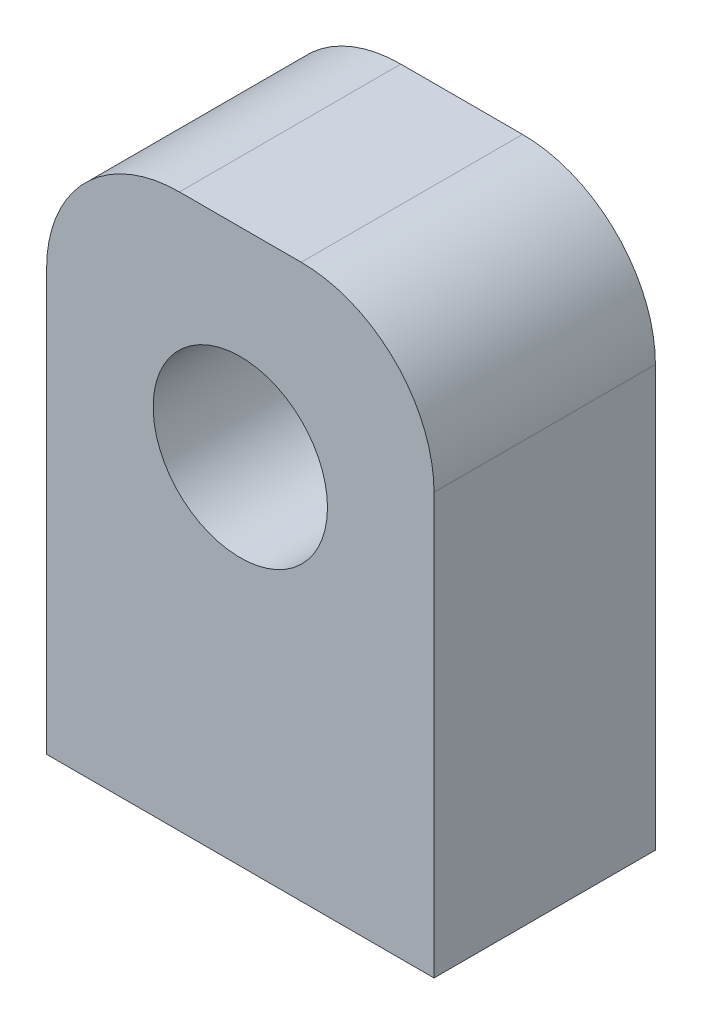
ISO-10303-21;
HEADER;
FILE_DESCRIPTION(('STEP AP214'),'2;1');
FILE_NAME('part.step','',(''),(''),'','','');
FILE_SCHEMA(('AUTOMOTIVE_DESIGN { 1 0 10303 214 1 1 1 1 }'));
ENDSEC;
DATA;
#1=APPLICATION_CONTEXT('core data for automotive mechanical design processes');
#2=APPLICATION_PROTOCOL_DEFINITION('international standard','automotive_design',2000,#1);
#3=PRODUCT_CONTEXT('',#1,'mechanical');
#4=PRODUCT('Part','Part','',(#3));
#5=PRODUCT_RELATED_PRODUCT_CATEGORY('part','',(#4));
#6=PRODUCT_DEFINITION_FORMATION('','',#4);
#7=PRODUCT_DEFINITION_CONTEXT('part definition',#1,'design');
#8=PRODUCT_DEFINITION('design','',#6,#7);
#9=PRODUCT_DEFINITION_SHAPE('','',#8);
#10=(LENGTH_UNIT() NAMED_UNIT(*) SI_UNIT(.MILLI.,.METRE.));
#11=(NAMED_UNIT(*) PLANE_ANGLE_UNIT() SI_UNIT($,.RADIAN.));
#12=(NAMED_UNIT(*) SI_UNIT($,.STERADIAN.) SOLID_ANGLE_UNIT());
#13=UNCERTAINTY_MEASURE_WITH_UNIT(LENGTH_MEASURE(1.E-05),#10,'distance_accuracy_value','');
#14=(GEOMETRIC_REPRESENTATION_CONTEXT(3) GLOBAL_UNCERTAINTY_ASSIGNED_CONTEXT((#13)) GLOBAL_UNIT_ASSIGNED_CONTEXT((#10,
#11,#12)) REPRESENTATION_CONTEXT('',''));
#15=CARTESIAN_POINT('',(0.,0.,0.));
#16=DIRECTION('',(0.,0.,1.));
#17=DIRECTION('',(1.,0.,0.));
#18=AXIS2_PLACEMENT_3D('',#15,#16,#17);
#19=CARTESIAN_POINT('',(-16.3353241489162,50.,-9.14482917573461));
#20=DIRECTION('',(1.,0.,0.));
#21=DIRECTION('',(0.,0.,-1.));
#22=AXIS2_PLACEMENT_3D('',#19,#20,#21);
#23=PLANE('',#22);
#24=DIRECTION('',(0.,-1.,0.));
#25=VECTOR('',#24,1.);
#26=CARTESIAN_POINT('',(-16.3353241489162,50.,10.8551708242654));
#27=LINE('',#26,#25);
#28=CARTESIAN_POINT('',(-16.3353241489162,38.,10.8551708242654));
#29=VERTEX_POINT('',#28);
#30=CARTESIAN_POINT('',(-16.3353241489162,0.,10.8551708242654));
#31=VERTEX_POINT('',#30);
#32=EDGE_CURVE('E84',#29,#31,#27,.T.);
#33=ORIENTED_EDGE('',*,*,#32,.F.);
#34=DIRECTION('',(0.,0.,1.));
#35=VECTOR('',#34,1.);
#36=CARTESIAN_POINT('',(-16.3353241489162,38.,-9.14482917573461));
#37=LINE('',#36,#35);
#38=CARTESIAN_POINT('',(-16.3353241489162,38.,-9.14482917573461));
#39=VERTEX_POINT('',#38);
#40=EDGE_CURVE('E11',#29,#39,#37,.F.);
#41=ORIENTED_EDGE('',*,*,#40,.T.);
#42=DIRECTION('',(0.,-1.,0.));
#43=VECTOR('',#42,1.);
#44=CARTESIAN_POINT('',(-16.3353241489162,50.,-9.14482917573461));
#45=LINE('',#44,#43);
#46=CARTESIAN_POINT('',(-16.3353241489162,0.,-9.14482917573461));
#47=VERTEX_POINT('',#46);
#48=EDGE_CURVE('E104',#39,#47,#45,.T.);
#49=ORIENTED_EDGE('',*,*,#48,.T.);
#50=DIRECTION('',(0.,0.,1.));
#51=VECTOR('',#50,1.);
#52=CARTESIAN_POINT('',(-16.3353241489162,0.,-9.14482917573461));
#53=LINE('',#52,#51);
#54=EDGE_CURVE('E99',#47,#31,#53,.T.);
#55=ORIENTED_EDGE('',*,*,#54,.T.);
#56=EDGE_LOOP('',(#33,#41,#49,#55));
#57=FACE_BOUND('',#56,.T.);
#58=ADVANCED_FACE('F33',(#57),#23,.F.);
#59=CARTESIAN_POINT('',(-16.3353241489162,50.,10.8551708242654));
#60=DIRECTION('',(0.,0.,-1.));
#61=DIRECTION('',(-1.,0.,0.));
#62=AXIS2_PLACEMENT_3D('',#59,#60,#61);
#63=PLANE('',#62);
#64=CARTESIAN_POINT('',(1.16467585108376,32.,10.8551708242654));
#65=DIRECTION('',(0.,0.,1.));
#66=DIRECTION('',(1.,0.,0.));
#67=AXIS2_PLACEMENT_3D('',#64,#65,#66);
#68=CIRCLE('',#67,7.875);
#69=CARTESIAN_POINT('',(9.03967585108376,32.,10.8551708242654));
#70=VERTEX_POINT('',#69);
#71=EDGE_CURVE('E109',#70,#70,#68,.T.);
#72=ORIENTED_EDGE('',*,*,#71,.F.);
#73=EDGE_LOOP('',(#72));
#74=FACE_BOUND('',#73,.T.);
#75=DIRECTION('',(0.,-1.,0.));
#76=VECTOR('',#75,1.);
#77=CARTESIAN_POINT('',(18.6646758510838,50.,10.8551708242654));
#78=LINE('',#77,#76);
#79=CARTESIAN_POINT('',(18.6646758510838,38.,10.8551708242654));
#80=VERTEX_POINT('',#79);
#81=CARTESIAN_POINT('',(18.6646758510838,0.,10.8551708242654));
#82=VERTEX_POINT('',#81);
#83=EDGE_CURVE('E93',#80,#82,#78,.T.);
#84=ORIENTED_EDGE('',*,*,#83,.F.);
#85=CARTESIAN_POINT('',(6.66467585108376,38.,10.8551708242654));
#86=DIRECTION('',(0.,0.,-1.));
#87=DIRECTION('',(-1.,0.,0.));
#88=AXIS2_PLACEMENT_3D('',#85,#86,#87);
#89=CIRCLE('',#88,12.);
#90=CARTESIAN_POINT('',(6.66467585108376,50.,10.8551708242654));
#91=VERTEX_POINT('',#90);
#92=EDGE_CURVE('E41',#80,#91,#89,.F.);
#93=ORIENTED_EDGE('',*,*,#92,.T.);
#94=DIRECTION('',(1.,0.,0.));
#95=VECTOR('',#94,1.);
#96=CARTESIAN_POINT('',(-16.3353241489162,50.,10.8551708242654));
#97=LINE('',#96,#95);
#98=CARTESIAN_POINT('',(-4.33532414891624,50.,10.8551708242654));
#99=VERTEX_POINT('',#98);
#100=EDGE_CURVE('E118',#99,#91,#97,.T.);
#101=ORIENTED_EDGE('',*,*,#100,.F.);
#102=CARTESIAN_POINT('',(-4.33532414891624,38.,10.8551708242654));
#103=DIRECTION('',(0.,0.,-1.));
#104=DIRECTION('',(-1.,0.,0.));
#105=AXIS2_PLACEMENT_3D('',#102,#103,#104);
#106=CIRCLE('',#105,12.);
#107=EDGE_CURVE('E48',#99,#29,#106,.F.);
#108=ORIENTED_EDGE('',*,*,#107,.T.);
#109=ORIENTED_EDGE('',*,*,#32,.T.);
#110=DIRECTION('',(1.,0.,0.));
#111=VECTOR('',#110,1.);
#112=CARTESIAN_POINT('',(-16.3353241489162,0.,10.8551708242654));
#113=LINE('',#112,#111);
#114=EDGE_CURVE('E87',#31,#82,#113,.T.);
#115=ORIENTED_EDGE('',*,*,#114,.T.);
#116=EDGE_LOOP('',(#84,#93,#101,#108,#109,#115));
#117=FACE_BOUND('',#116,.T.);
#118=ADVANCED_FACE('F86',(#74,#117),#63,.F.);
#119=CARTESIAN_POINT('',(18.6646758510838,50.,-9.14482917573461));
#120=DIRECTION('',(-1.,0.,0.));
#121=DIRECTION('',(0.,0.,1.));
#122=AXIS2_PLACEMENT_3D('',#119,#120,#121);
#123=PLANE('',#122);
#124=DIRECTION('',(0.,-1.,0.));
#125=VECTOR('',#124,1.);
#126=CARTESIAN_POINT('',(18.6646758510838,50.,-9.14482917573461));
#127=LINE('',#126,#125);
#128=CARTESIAN_POINT('',(18.6646758510838,38.,-9.14482917573461));
#129=VERTEX_POINT('',#128);
#130=CARTESIAN_POINT('',(18.6646758510838,0.,-9.14482917573461));
#131=VERTEX_POINT('',#130);
#132=EDGE_CURVE('E120',#129,#131,#127,.T.);
#133=ORIENTED_EDGE('',*,*,#132,.F.);
#134=DIRECTION('',(0.,0.,-1.));
#135=VECTOR('',#134,1.);
#136=CARTESIAN_POINT('',(18.6646758510838,38.,10.8551708242654));
#137=LINE('',#136,#135);
#138=EDGE_CURVE('E56',#129,#80,#137,.F.);
#139=ORIENTED_EDGE('',*,*,#138,.T.);
#140=ORIENTED_EDGE('',*,*,#83,.T.);
#141=DIRECTION('',(0.,0.,-1.));
#142=VECTOR('',#141,1.);
#143=CARTESIAN_POINT('',(18.6646758510838,0.,-9.14482917573461));
#144=LINE('',#143,#142);
#145=EDGE_CURVE('E101',#82,#131,#144,.T.);
#146=ORIENTED_EDGE('',*,*,#145,.T.);
#147=EDGE_LOOP('',(#133,#139,#140,#146));
#148=FACE_BOUND('',#147,.T.);
#149=ADVANCED_FACE('F145',(#148),#123,.F.);
#150=CARTESIAN_POINT('',(-16.3353241489162,50.,-9.14482917573461));
#151=DIRECTION('',(0.,0.,1.));
#152=DIRECTION('',(1.,0.,0.));
#153=AXIS2_PLACEMENT_3D('',#150,#151,#152);
#154=PLANE('',#153);
#155=CARTESIAN_POINT('',(1.16467585108376,32.,-9.14482917573461));
#156=DIRECTION('',(0.,0.,1.));
#157=DIRECTION('',(1.,0.,0.));
#158=AXIS2_PLACEMENT_3D('',#155,#156,#157);
#159=CIRCLE('',#158,7.875);
#160=CARTESIAN_POINT('',(9.03967585108376,32.,-9.14482917573461));
#161=VERTEX_POINT('',#160);
#162=EDGE_CURVE('E106',#161,#161,#159,.T.);
#163=ORIENTED_EDGE('',*,*,#162,.T.);
#164=EDGE_LOOP('',(#163));
#165=FACE_BOUND('',#164,.T.);
#166=DIRECTION('',(-1.,0.,0.));
#167=VECTOR('',#166,1.);
#168=CARTESIAN_POINT('',(-16.3353241489162,50.,-9.14482917573461));
#169=LINE('',#168,#167);
#170=CARTESIAN_POINT('',(6.66467585108376,50.,-9.14482917573461));
#171=VERTEX_POINT('',#170);
#172=CARTESIAN_POINT('',(-4.33532414891625,50.,-9.14482917573461));
#173=VERTEX_POINT('',#172);
#174=EDGE_CURVE('E112',#171,#173,#169,.T.);
#175=ORIENTED_EDGE('',*,*,#174,.F.);
#176=CARTESIAN_POINT('',(6.66467585108376,38.,-9.14482917573461));
#177=DIRECTION('',(0.,0.,1.));
#178=DIRECTION('',(1.,0.,0.));
#179=AXIS2_PLACEMENT_3D('',#176,#177,#178);
#180=CIRCLE('',#179,12.);
#181=EDGE_CURVE('E130',#171,#129,#180,.F.);
#182=ORIENTED_EDGE('',*,*,#181,.T.);
#183=ORIENTED_EDGE('',*,*,#132,.T.);
#184=DIRECTION('',(-1.,0.,0.));
#185=VECTOR('',#184,1.);
#186=CARTESIAN_POINT('',(-16.3353241489162,0.,-9.14482917573461));
#187=LINE('',#186,#185);
#188=EDGE_CURVE('E116',#131,#47,#187,.T.);
#189=ORIENTED_EDGE('',*,*,#188,.T.);
#190=ORIENTED_EDGE('',*,*,#48,.F.);
#191=CARTESIAN_POINT('',(-4.33532414891625,38.,-9.14482917573461));
#192=DIRECTION('',(0.,0.,1.));
#193=DIRECTION('',(1.,0.,0.));
#194=AXIS2_PLACEMENT_3D('',#191,#192,#193);
#195=CIRCLE('',#194,12.);
#196=EDGE_CURVE('E128',#39,#173,#195,.F.);
#197=ORIENTED_EDGE('',*,*,#196,.T.);
#198=EDGE_LOOP('',(#175,#182,#183,#189,#190,#197));
#199=FACE_BOUND('',#198,.T.);
#200=ADVANCED_FACE('F144',(#165,#199),#154,.F.);
#201=CARTESIAN_POINT('',(0.,50.,0.));
#202=DIRECTION('',(0.,1.,0.));
#203=DIRECTION('',(0.,0.,1.));
#204=AXIS2_PLACEMENT_3D('',#201,#202,#203);
#205=PLANE('',#204);
#206=ORIENTED_EDGE('',*,*,#100,.T.);
#207=DIRECTION('',(0.,0.,-1.));
#208=VECTOR('',#207,1.);
#209=CARTESIAN_POINT('',(6.66467585108376,50.,-9.14482917573461));
#210=LINE('',#209,#208);
#211=EDGE_CURVE('E125',#91,#171,#210,.T.);
#212=ORIENTED_EDGE('',*,*,#211,.T.);
#213=ORIENTED_EDGE('',*,*,#174,.T.);
#214=DIRECTION('',(0.,0.,1.));
#215=VECTOR('',#214,1.);
#216=CARTESIAN_POINT('',(-4.33532414891624,50.,10.8551708242654));
#217=LINE('',#216,#215);
#218=EDGE_CURVE('E92',#173,#99,#217,.T.);
#219=ORIENTED_EDGE('',*,*,#218,.T.);
#220=EDGE_LOOP('',(#206,#212,#213,#219));
#221=FACE_BOUND('',#220,.T.);
#222=ADVANCED_FACE('F138',(#221),#205,.T.);
#223=CARTESIAN_POINT('',(0.,0.,0.));
#224=DIRECTION('',(0.,1.,0.));
#225=DIRECTION('',(0.,0.,1.));
#226=AXIS2_PLACEMENT_3D('',#223,#224,#225);
#227=PLANE('',#226);
#228=CARTESIAN_POINT('',(10.6646758510838,0.,0.855170824265387));
#229=DIRECTION('',(0.,-1.,0.));
#230=DIRECTION('',(0.,0.,-1.));
#231=AXIS2_PLACEMENT_3D('',#228,#229,#230);
#232=CIRCLE('',#231,1.75);
#233=CARTESIAN_POINT('',(10.6646758510838,0.,-0.894829175734613));
#234=VERTEX_POINT('',#233);
#235=EDGE_CURVE('E195',#234,#234,#232,.T.);
#236=ORIENTED_EDGE('',*,*,#235,.F.);
#237=EDGE_LOOP('',(#236));
#238=FACE_BOUND('',#237,.T.);
#239=CARTESIAN_POINT('',(-8.33532414891625,0.,0.855170824265387));
#240=DIRECTION('',(0.,-1.,0.));
#241=DIRECTION('',(0.,0.,-1.));
#242=AXIS2_PLACEMENT_3D('',#239,#240,#241);
#243=CIRCLE('',#242,1.75);
#244=CARTESIAN_POINT('',(-8.33532414891625,0.,-0.894829175734613));
#245=VERTEX_POINT('',#244);
#246=EDGE_CURVE('E194',#245,#245,#243,.T.);
#247=ORIENTED_EDGE('',*,*,#246,.F.);
#248=EDGE_LOOP('',(#247));
#249=FACE_BOUND('',#248,.T.);
#250=ORIENTED_EDGE('',*,*,#54,.F.);
#251=ORIENTED_EDGE('',*,*,#188,.F.);
#252=ORIENTED_EDGE('',*,*,#145,.F.);
#253=ORIENTED_EDGE('',*,*,#114,.F.);
#254=EDGE_LOOP('',(#250,#251,#252,#253));
#255=FACE_BOUND('',#254,.T.);
#256=ADVANCED_FACE('F97',(#238,#249,#255),#227,.F.);
#257=CARTESIAN_POINT('',(1.16467585108376,32.,-9.14482917573461));
#258=DIRECTION('',(0.,0.,1.));
#259=DIRECTION('',(1.,0.,0.));
#260=AXIS2_PLACEMENT_3D('',#257,#258,#259);
#261=CYLINDRICAL_SURFACE('',#260,7.875);
#262=ORIENTED_EDGE('',*,*,#162,.F.);
#263=EDGE_LOOP('',(#262));
#264=FACE_BOUND('',#263,.T.);
#265=ORIENTED_EDGE('',*,*,#71,.T.);
#266=EDGE_LOOP('',(#265));
#267=FACE_BOUND('',#266,.T.);
#268=ADVANCED_FACE('F168',(#264,#267),#261,.F.);
#269=CARTESIAN_POINT('',(-8.33532414891625,10.,0.855170824265387));
#270=DIRECTION('',(0.,-1.,0.));
#271=DIRECTION('',(0.,0.,-1.));
#272=AXIS2_PLACEMENT_3D('',#269,#270,#271);
#273=CYLINDRICAL_SURFACE('',#272,1.75);
#274=CARTESIAN_POINT('',(-8.33532414891625,10.,0.855170824265387));
#275=DIRECTION('',(0.,-1.,0.));
#276=DIRECTION('',(0.,0.,-1.));
#277=AXIS2_PLACEMENT_3D('',#274,#275,#276);
#278=CIRCLE('',#277,1.75);
#279=CARTESIAN_POINT('',(-8.33532414891625,10.,-0.894829175734613));
#280=VERTEX_POINT('',#279);
#281=EDGE_CURVE('E198',#280,#280,#278,.T.);
#282=ORIENTED_EDGE('',*,*,#281,.F.);
#283=EDGE_LOOP('',(#282));
#284=FACE_BOUND('',#283,.T.);
#285=ORIENTED_EDGE('',*,*,#246,.T.);
#286=EDGE_LOOP('',(#285));
#287=FACE_BOUND('',#286,.T.);
#288=ADVANCED_FACE('F174',(#284,#287),#273,.F.);
#289=CARTESIAN_POINT('',(-8.33532414891625,10.,0.855170824265387));
#290=DIRECTION('',(0.,-1.,0.));
#291=DIRECTION('',(0.,0.,-1.));
#292=AXIS2_PLACEMENT_3D('',#289,#290,#291);
#293=PLANE('',#292);
#294=ORIENTED_EDGE('',*,*,#281,.T.);
#295=EDGE_LOOP('',(#294));
#296=FACE_BOUND('',#295,.T.);
#297=ADVANCED_FACE('F178',(#296),#293,.T.);
#298=CARTESIAN_POINT('',(10.6646758510838,10.,0.855170824265387));
#299=DIRECTION('',(0.,-1.,0.));
#300=DIRECTION('',(0.,0.,-1.));
#301=AXIS2_PLACEMENT_3D('',#298,#299,#300);
#302=CYLINDRICAL_SURFACE('',#301,1.75);
#303=CARTESIAN_POINT('',(10.6646758510838,10.,0.855170824265387));
#304=DIRECTION('',(0.,-1.,0.));
#305=DIRECTION('',(0.,0.,-1.));
#306=AXIS2_PLACEMENT_3D('',#303,#304,#305);
#307=CIRCLE('',#306,1.75);
#308=CARTESIAN_POINT('',(10.6646758510838,10.,-0.894829175734613));
#309=VERTEX_POINT('',#308);
#310=EDGE_CURVE('E193',#309,#309,#307,.T.);
#311=ORIENTED_EDGE('',*,*,#310,.F.);
#312=EDGE_LOOP('',(#311));
#313=FACE_BOUND('',#312,.T.);
#314=ORIENTED_EDGE('',*,*,#235,.T.);
#315=EDGE_LOOP('',(#314));
#316=FACE_BOUND('',#315,.T.);
#317=ADVANCED_FACE('F182',(#313,#316),#302,.F.);
#318=CARTESIAN_POINT('',(10.6646758510838,10.,0.855170824265387));
#319=DIRECTION('',(0.,-1.,0.));
#320=DIRECTION('',(0.,0.,-1.));
#321=AXIS2_PLACEMENT_3D('',#318,#319,#320);
#322=PLANE('',#321);
#323=ORIENTED_EDGE('',*,*,#310,.T.);
#324=EDGE_LOOP('',(#323));
#325=FACE_BOUND('',#324,.T.);
#326=ADVANCED_FACE('F152',(#325),#322,.T.);
#327=CARTESIAN_POINT('',(6.66467585108376,38.,0.));
#328=DIRECTION('',(0.,0.,1.));
#329=DIRECTION('',(1.,0.,0.));
#330=AXIS2_PLACEMENT_3D('',#327,#328,#329);
#331=CYLINDRICAL_SURFACE('',#330,12.);
#332=ORIENTED_EDGE('',*,*,#92,.F.);
#333=ORIENTED_EDGE('',*,*,#138,.F.);
#334=ORIENTED_EDGE('',*,*,#181,.F.);
#335=ORIENTED_EDGE('',*,*,#211,.F.);
#336=EDGE_LOOP('',(#332,#333,#334,#335));
#337=FACE_BOUND('',#336,.T.);
#338=ADVANCED_FACE('F142',(#337),#331,.T.);
#339=CARTESIAN_POINT('',(-4.33532414891625,38.,0.));
#340=DIRECTION('',(0.,0.,-1.));
#341=DIRECTION('',(-1.,0.,0.));
#342=AXIS2_PLACEMENT_3D('',#339,#340,#341);
#343=CYLINDRICAL_SURFACE('',#342,12.);
#344=ORIENTED_EDGE('',*,*,#196,.F.);
#345=ORIENTED_EDGE('',*,*,#40,.F.);
#346=ORIENTED_EDGE('',*,*,#107,.F.);
#347=ORIENTED_EDGE('',*,*,#218,.F.);
#348=EDGE_LOOP('',(#344,#345,#346,#347));
#349=FACE_BOUND('',#348,.T.);
#350=ADVANCED_FACE('F35',(#349),#343,.T.);
#351=CLOSED_SHELL('',(#58,#118,#149,#200,#222,#256,#268,#288,#297,#317,#326,#338,#350));
#352=MANIFOLD_SOLID_BREP('B2',#351);
#353=ADVANCED_BREP_SHAPE_REPRESENTATION('',(#18,#352),#14);
#354=SHAPE_DEFINITION_REPRESENTATION(#9,#353);
ENDSEC;
END-ISO-10303-21;
